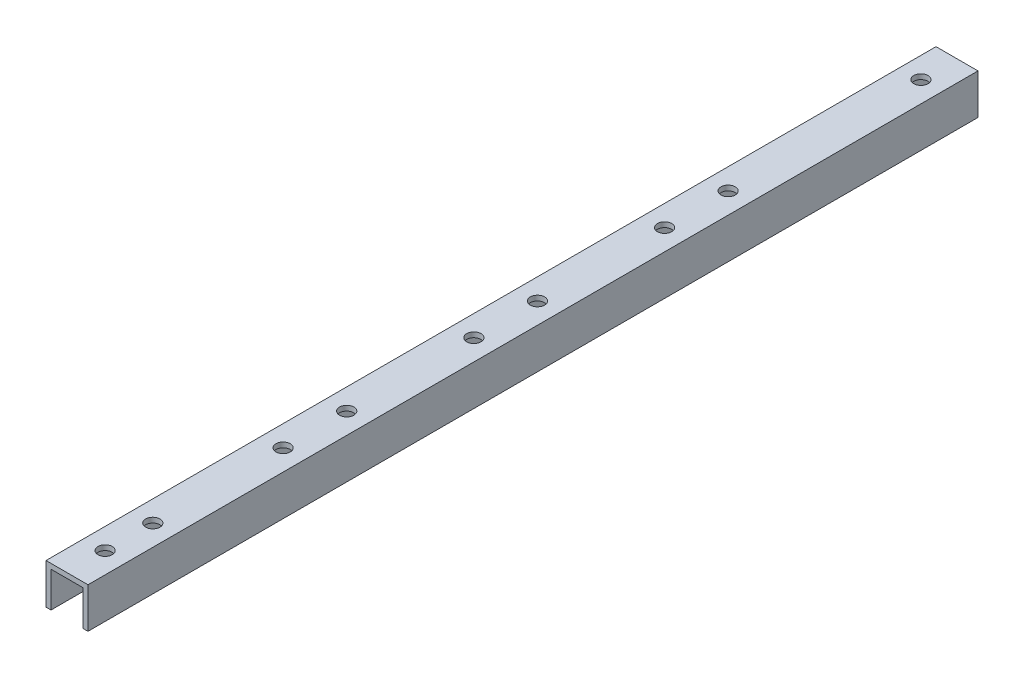
ISO-10303-21;
HEADER;
FILE_DESCRIPTION(('STEP AP214'),'2;1');
FILE_NAME('part.step','',(''),(''),'','','');
FILE_SCHEMA(('AUTOMOTIVE_DESIGN { 1 0 10303 214 1 1 1 1 }'));
ENDSEC;
DATA;
#1=APPLICATION_CONTEXT('core data for automotive mechanical design processes');
#2=APPLICATION_PROTOCOL_DEFINITION('international standard','automotive_design',2000,#1);
#3=PRODUCT_CONTEXT('',#1,'mechanical');
#4=PRODUCT('Part','Part','',(#3));
#5=PRODUCT_RELATED_PRODUCT_CATEGORY('part','',(#4));
#6=PRODUCT_DEFINITION_FORMATION('','',#4);
#7=PRODUCT_DEFINITION_CONTEXT('part definition',#1,'design');
#8=PRODUCT_DEFINITION('design','',#6,#7);
#9=PRODUCT_DEFINITION_SHAPE('','',#8);
#10=(LENGTH_UNIT() NAMED_UNIT(*) SI_UNIT(.MILLI.,.METRE.));
#11=(NAMED_UNIT(*) PLANE_ANGLE_UNIT() SI_UNIT($,.RADIAN.));
#12=(NAMED_UNIT(*) SI_UNIT($,.STERADIAN.) SOLID_ANGLE_UNIT());
#13=UNCERTAINTY_MEASURE_WITH_UNIT(LENGTH_MEASURE(1.E-05),#10,'distance_accuracy_value','');
#14=(GEOMETRIC_REPRESENTATION_CONTEXT(3) GLOBAL_UNCERTAINTY_ASSIGNED_CONTEXT((#13)) GLOBAL_UNIT_ASSIGNED_CONTEXT((#10,
#11,#12)) REPRESENTATION_CONTEXT('',''));
#15=CARTESIAN_POINT('',(0.,0.,0.));
#16=DIRECTION('',(0.,0.,1.));
#17=DIRECTION('',(1.,0.,0.));
#18=AXIS2_PLACEMENT_3D('',#15,#16,#17);
#19=CARTESIAN_POINT('',(-6.604,0.,20.));
#20=DIRECTION('',(0.,-1.,0.));
#21=DIRECTION('',(1.,0.,0.));
#22=AXIS2_PLACEMENT_3D('',#19,#20,#21);
#23=PLANE('',#22);
#24=CARTESIAN_POINT('',(0.,0.,-108.));
#25=DIRECTION('',(0.,1.,0.));
#26=DIRECTION('',(0.,0.,1.));
#27=AXIS2_PLACEMENT_3D('',#24,#25,#26);
#28=CIRCLE('',#27,2.24999999999999);
#29=CARTESIAN_POINT('',(0.,0.,-105.75));
#30=VERTEX_POINT('',#29);
#31=EDGE_CURVE('E408',#30,#30,#28,.T.);
#32=ORIENTED_EDGE('',*,*,#31,.F.);
#33=EDGE_LOOP('',(#32));
#34=FACE_BOUND('',#33,.T.);
#35=CARTESIAN_POINT('',(0.,0.,-128.));
#36=DIRECTION('',(0.,1.,0.));
#37=DIRECTION('',(0.,0.,1.));
#38=AXIS2_PLACEMENT_3D('',#35,#36,#37);
#39=CIRCLE('',#38,2.24999999999999);
#40=CARTESIAN_POINT('',(0.,0.,-125.75));
#41=VERTEX_POINT('',#40);
#42=EDGE_CURVE('E412',#41,#41,#39,.T.);
#43=ORIENTED_EDGE('',*,*,#42,.F.);
#44=EDGE_LOOP('',(#43));
#45=FACE_BOUND('',#44,.T.);
#46=CARTESIAN_POINT('',(0.,0.,8.));
#47=DIRECTION('',(0.,1.,0.));
#48=DIRECTION('',(0.,0.,1.));
#49=AXIS2_PLACEMENT_3D('',#46,#47,#48);
#50=CIRCLE('',#49,2.24999999999999);
#51=CARTESIAN_POINT('',(0.,0.,10.25));
#52=VERTEX_POINT('',#51);
#53=EDGE_CURVE('E418',#52,#52,#50,.T.);
#54=ORIENTED_EDGE('',*,*,#53,.F.);
#55=EDGE_LOOP('',(#54));
#56=FACE_BOUND('',#55,.T.);
#57=CARTESIAN_POINT('',(0.,0.,-188.));
#58=DIRECTION('',(0.,1.,0.));
#59=DIRECTION('',(0.,0.,1.));
#60=AXIS2_PLACEMENT_3D('',#57,#58,#59);
#61=CIRCLE('',#60,2.24999999999999);
#62=CARTESIAN_POINT('',(0.,0.,-185.75));
#63=VERTEX_POINT('',#62);
#64=EDGE_CURVE('E190',#63,#63,#61,.T.);
#65=ORIENTED_EDGE('',*,*,#64,.F.);
#66=EDGE_LOOP('',(#65));
#67=FACE_BOUND('',#66,.T.);
#68=CARTESIAN_POINT('',(0.,0.,-168.));
#69=DIRECTION('',(0.,1.,0.));
#70=DIRECTION('',(0.,0.,1.));
#71=AXIS2_PLACEMENT_3D('',#68,#69,#70);
#72=CIRCLE('',#71,2.24999999999999);
#73=CARTESIAN_POINT('',(0.,0.,-165.75));
#74=VERTEX_POINT('',#73);
#75=EDGE_CURVE('E179',#74,#74,#72,.T.);
#76=ORIENTED_EDGE('',*,*,#75,.F.);
#77=EDGE_LOOP('',(#76));
#78=FACE_BOUND('',#77,.T.);
#79=CARTESIAN_POINT('',(0.,0.,-68.));
#80=DIRECTION('',(0.,1.,0.));
#81=DIRECTION('',(0.,0.,1.));
#82=AXIS2_PLACEMENT_3D('',#79,#80,#81);
#83=CIRCLE('',#82,2.24999999999999);
#84=CARTESIAN_POINT('',(0.,0.,-65.75));
#85=VERTEX_POINT('',#84);
#86=EDGE_CURVE('E176',#85,#85,#83,.T.);
#87=ORIENTED_EDGE('',*,*,#86,.F.);
#88=EDGE_LOOP('',(#87));
#89=FACE_BOUND('',#88,.T.);
#90=CARTESIAN_POINT('',(0.,0.,-7.));
#91=DIRECTION('',(0.,1.,0.));
#92=DIRECTION('',(0.,0.,1.));
#93=AXIS2_PLACEMENT_3D('',#90,#91,#92);
#94=CIRCLE('',#93,2.24999999999999);
#95=CARTESIAN_POINT('',(0.,0.,-4.75000000000001));
#96=VERTEX_POINT('',#95);
#97=EDGE_CURVE('E169',#96,#96,#94,.T.);
#98=ORIENTED_EDGE('',*,*,#97,.F.);
#99=EDGE_LOOP('',(#98));
#100=FACE_BOUND('',#99,.T.);
#101=CARTESIAN_POINT('',(0.,0.,-248.64));
#102=DIRECTION('',(0.,1.,0.));
#103=DIRECTION('',(0.,0.,1.));
#104=AXIS2_PLACEMENT_3D('',#101,#102,#103);
#105=CIRCLE('',#104,2.24999999999999);
#106=CARTESIAN_POINT('',(0.,0.,-246.39));
#107=VERTEX_POINT('',#106);
#108=EDGE_CURVE('E122',#107,#107,#105,.T.);
#109=ORIENTED_EDGE('',*,*,#108,.F.);
#110=EDGE_LOOP('',(#109));
#111=FACE_BOUND('',#110,.T.);
#112=DIRECTION('',(0.,0.,-1.));
#113=VECTOR('',#112,1.);
#114=CARTESIAN_POINT('',(6.604,0.,20.));
#115=LINE('',#114,#113);
#116=CARTESIAN_POINT('',(6.604,0.,20.));
#117=VERTEX_POINT('',#116);
#118=CARTESIAN_POINT('',(6.604,0.,-260.));
#119=VERTEX_POINT('',#118);
#120=EDGE_CURVE('E155',#117,#119,#115,.T.);
#121=ORIENTED_EDGE('',*,*,#120,.T.);
#122=DIRECTION('',(-1.,0.,0.));
#123=VECTOR('',#122,1.);
#124=CARTESIAN_POINT('',(-6.604,0.,-260.));
#125=LINE('',#124,#123);
#126=CARTESIAN_POINT('',(-6.604,0.,-260.));
#127=VERTEX_POINT('',#126);
#128=EDGE_CURVE('E139',#119,#127,#125,.T.);
#129=ORIENTED_EDGE('',*,*,#128,.T.);
#130=DIRECTION('',(0.,0.,-1.));
#131=VECTOR('',#130,1.);
#132=CARTESIAN_POINT('',(-6.604,0.,20.));
#133=LINE('',#132,#131);
#134=CARTESIAN_POINT('',(-6.604,0.,20.));
#135=VERTEX_POINT('',#134);
#136=EDGE_CURVE('E118',#135,#127,#133,.T.);
#137=ORIENTED_EDGE('',*,*,#136,.F.);
#138=DIRECTION('',(-1.,0.,0.));
#139=VECTOR('',#138,1.);
#140=CARTESIAN_POINT('',(-6.604,0.,20.));
#141=LINE('',#140,#139);
#142=EDGE_CURVE('E50',#117,#135,#141,.T.);
#143=ORIENTED_EDGE('',*,*,#142,.F.);
#144=EDGE_LOOP('',(#121,#129,#137,#143));
#145=FACE_BOUND('',#144,.T.);
#146=CARTESIAN_POINT('',(0.,0.,-48.));
#147=DIRECTION('',(0.,1.,0.));
#148=DIRECTION('',(0.,0.,1.));
#149=AXIS2_PLACEMENT_3D('',#146,#147,#148);
#150=CIRCLE('',#149,2.24999999999999);
#151=CARTESIAN_POINT('',(0.,0.,-45.75));
#152=VERTEX_POINT('',#151);
#153=EDGE_CURVE('E173',#152,#152,#150,.T.);
#154=ORIENTED_EDGE('',*,*,#153,.F.);
#155=EDGE_LOOP('',(#154));
#156=FACE_BOUND('',#155,.T.);
#157=ADVANCED_FACE('F33',(#34,#45,#56,#67,#78,#89,#100,#111,#145,#156),#23,.F.);
#158=CARTESIAN_POINT('',(-6.604,0.,20.));
#159=DIRECTION('',(1.,0.,0.));
#160=DIRECTION('',(0.,1.,0.));
#161=AXIS2_PLACEMENT_3D('',#158,#159,#160);
#162=PLANE('',#161);
#163=ORIENTED_EDGE('',*,*,#136,.T.);
#164=DIRECTION('',(0.,-1.,0.));
#165=VECTOR('',#164,1.);
#166=CARTESIAN_POINT('',(-6.604,0.,-260.));
#167=LINE('',#166,#165);
#168=CARTESIAN_POINT('',(-6.604,-12.7,-260.));
#169=VERTEX_POINT('',#168);
#170=EDGE_CURVE('E112',#127,#169,#167,.T.);
#171=ORIENTED_EDGE('',*,*,#170,.T.);
#172=DIRECTION('',(0.,0.,-1.));
#173=VECTOR('',#172,1.);
#174=CARTESIAN_POINT('',(-6.604,-12.7,20.));
#175=LINE('',#174,#173);
#176=CARTESIAN_POINT('',(-6.604,-12.7,20.));
#177=VERTEX_POINT('',#176);
#178=EDGE_CURVE('E11',#177,#169,#175,.T.);
#179=ORIENTED_EDGE('',*,*,#178,.F.);
#180=DIRECTION('',(0.,-1.,0.));
#181=VECTOR('',#180,1.);
#182=CARTESIAN_POINT('',(-6.604,0.,20.));
#183=LINE('',#182,#181);
#184=EDGE_CURVE('E141',#135,#177,#183,.T.);
#185=ORIENTED_EDGE('',*,*,#184,.F.);
#186=EDGE_LOOP('',(#163,#171,#179,#185));
#187=FACE_BOUND('',#186,.T.);
#188=ADVANCED_FACE('F35',(#187),#162,.F.);
#189=CARTESIAN_POINT('',(-6.604,-12.7,20.));
#190=DIRECTION('',(0.,1.,0.));
#191=DIRECTION('',(0.,0.,1.));
#192=AXIS2_PLACEMENT_3D('',#189,#190,#191);
#193=PLANE('',#192);
#194=ORIENTED_EDGE('',*,*,#178,.T.);
#195=DIRECTION('',(1.,0.,0.));
#196=VECTOR('',#195,1.);
#197=CARTESIAN_POINT('',(-6.604,-12.7,-260.));
#198=LINE('',#197,#196);
#199=CARTESIAN_POINT('',(-5.0165,-12.7,-260.));
#200=VERTEX_POINT('',#199);
#201=EDGE_CURVE('E102',#169,#200,#198,.T.);
#202=ORIENTED_EDGE('',*,*,#201,.T.);
#203=DIRECTION('',(0.,0.,-1.));
#204=VECTOR('',#203,1.);
#205=CARTESIAN_POINT('',(-5.0165,-12.7,20.));
#206=LINE('',#205,#204);
#207=CARTESIAN_POINT('',(-5.0165,-12.7,20.));
#208=VERTEX_POINT('',#207);
#209=EDGE_CURVE('E42',#208,#200,#206,.T.);
#210=ORIENTED_EDGE('',*,*,#209,.F.);
#211=DIRECTION('',(1.,0.,0.));
#212=VECTOR('',#211,1.);
#213=CARTESIAN_POINT('',(-6.604,-12.7,20.));
#214=LINE('',#213,#212);
#215=EDGE_CURVE('E103',#177,#208,#214,.T.);
#216=ORIENTED_EDGE('',*,*,#215,.F.);
#217=EDGE_LOOP('',(#194,#202,#210,#216));
#218=FACE_BOUND('',#217,.T.);
#219=ADVANCED_FACE('F100',(#218),#193,.F.);
#220=CARTESIAN_POINT('',(-5.0165,-12.7,20.));
#221=DIRECTION('',(-1.,0.,0.));
#222=DIRECTION('',(0.,-1.,0.));
#223=AXIS2_PLACEMENT_3D('',#220,#221,#222);
#224=PLANE('',#223);
#225=ORIENTED_EDGE('',*,*,#209,.T.);
#226=DIRECTION('',(0.,1.,0.));
#227=VECTOR('',#226,1.);
#228=CARTESIAN_POINT('',(-5.0165,-12.7,-260.));
#229=LINE('',#228,#227);
#230=CARTESIAN_POINT('',(-5.0165,-1.5875,-260.));
#231=VERTEX_POINT('',#230);
#232=EDGE_CURVE('E116',#200,#231,#229,.T.);
#233=ORIENTED_EDGE('',*,*,#232,.T.);
#234=DIRECTION('',(0.,0.,-1.));
#235=VECTOR('',#234,1.);
#236=CARTESIAN_POINT('',(-5.0165,-1.5875,20.));
#237=LINE('',#236,#235);
#238=CARTESIAN_POINT('',(-5.0165,-1.5875,20.));
#239=VERTEX_POINT('',#238);
#240=EDGE_CURVE('E163',#239,#231,#237,.T.);
#241=ORIENTED_EDGE('',*,*,#240,.F.);
#242=DIRECTION('',(0.,1.,0.));
#243=VECTOR('',#242,1.);
#244=CARTESIAN_POINT('',(-5.0165,-12.7,20.));
#245=LINE('',#244,#243);
#246=EDGE_CURVE('E144',#208,#239,#245,.T.);
#247=ORIENTED_EDGE('',*,*,#246,.F.);
#248=EDGE_LOOP('',(#225,#233,#241,#247));
#249=FACE_BOUND('',#248,.T.);
#250=ADVANCED_FACE('F222',(#249),#224,.F.);
#251=CARTESIAN_POINT('',(5.0165,-1.5875,20.));
#252=DIRECTION('',(0.,1.,0.));
#253=DIRECTION('',(-1.,0.,0.));
#254=AXIS2_PLACEMENT_3D('',#251,#252,#253);
#255=PLANE('',#254);
#256=CARTESIAN_POINT('',(0.,-1.5875,-108.));
#257=DIRECTION('',(0.,1.,0.));
#258=DIRECTION('',(-1.,0.,0.));
#259=AXIS2_PLACEMENT_3D('',#256,#257,#258);
#260=CIRCLE('',#259,2.24999999999997);
#261=CARTESIAN_POINT('',(-2.24999999999997,-1.5875,-108.));
#262=VERTEX_POINT('',#261);
#263=EDGE_CURVE('E411',#262,#262,#260,.T.);
#264=ORIENTED_EDGE('',*,*,#263,.T.);
#265=EDGE_LOOP('',(#264));
#266=FACE_BOUND('',#265,.T.);
#267=CARTESIAN_POINT('',(0.,-1.5875,-128.));
#268=DIRECTION('',(0.,1.,0.));
#269=DIRECTION('',(-1.,0.,0.));
#270=AXIS2_PLACEMENT_3D('',#267,#268,#269);
#271=CIRCLE('',#270,2.24999999999997);
#272=CARTESIAN_POINT('',(-2.24999999999997,-1.5875,-128.));
#273=VERTEX_POINT('',#272);
#274=EDGE_CURVE('E37',#273,#273,#271,.T.);
#275=ORIENTED_EDGE('',*,*,#274,.T.);
#276=EDGE_LOOP('',(#275));
#277=FACE_BOUND('',#276,.T.);
#278=CARTESIAN_POINT('',(0.,-1.5875,8.));
#279=DIRECTION('',(0.,1.,0.));
#280=DIRECTION('',(-1.,0.,0.));
#281=AXIS2_PLACEMENT_3D('',#278,#279,#280);
#282=CIRCLE('',#281,2.24999999999997);
#283=CARTESIAN_POINT('',(-2.24999999999997,-1.5875,8.));
#284=VERTEX_POINT('',#283);
#285=EDGE_CURVE('E421',#284,#284,#282,.T.);
#286=ORIENTED_EDGE('',*,*,#285,.T.);
#287=EDGE_LOOP('',(#286));
#288=FACE_BOUND('',#287,.T.);
#289=CARTESIAN_POINT('',(0.,-1.5875,-188.));
#290=DIRECTION('',(0.,1.,0.));
#291=DIRECTION('',(-1.,0.,0.));
#292=AXIS2_PLACEMENT_3D('',#289,#290,#291);
#293=CIRCLE('',#292,2.24999999999997);
#294=CARTESIAN_POINT('',(-2.24999999999997,-1.5875,-188.));
#295=VERTEX_POINT('',#294);
#296=EDGE_CURVE('E185',#295,#295,#293,.T.);
#297=ORIENTED_EDGE('',*,*,#296,.T.);
#298=EDGE_LOOP('',(#297));
#299=FACE_BOUND('',#298,.T.);
#300=CARTESIAN_POINT('',(0.,-1.5875,-168.));
#301=DIRECTION('',(0.,1.,0.));
#302=DIRECTION('',(-1.,0.,0.));
#303=AXIS2_PLACEMENT_3D('',#300,#301,#302);
#304=CIRCLE('',#303,2.24999999999997);
#305=CARTESIAN_POINT('',(-2.24999999999997,-1.5875,-168.));
#306=VERTEX_POINT('',#305);
#307=EDGE_CURVE('E177',#306,#306,#304,.T.);
#308=ORIENTED_EDGE('',*,*,#307,.T.);
#309=EDGE_LOOP('',(#308));
#310=FACE_BOUND('',#309,.T.);
#311=CARTESIAN_POINT('',(0.,-1.5875,-68.));
#312=DIRECTION('',(0.,1.,0.));
#313=DIRECTION('',(-1.,0.,0.));
#314=AXIS2_PLACEMENT_3D('',#311,#312,#313);
#315=CIRCLE('',#314,2.24999999999997);
#316=CARTESIAN_POINT('',(-2.24999999999997,-1.5875,-68.));
#317=VERTEX_POINT('',#316);
#318=EDGE_CURVE('E174',#317,#317,#315,.T.);
#319=ORIENTED_EDGE('',*,*,#318,.T.);
#320=EDGE_LOOP('',(#319));
#321=FACE_BOUND('',#320,.T.);
#322=CARTESIAN_POINT('',(0.,-1.5875,-48.));
#323=DIRECTION('',(0.,1.,0.));
#324=DIRECTION('',(-1.,0.,0.));
#325=AXIS2_PLACEMENT_3D('',#322,#323,#324);
#326=CIRCLE('',#325,2.24999999999997);
#327=CARTESIAN_POINT('',(-2.24999999999997,-1.5875,-48.));
#328=VERTEX_POINT('',#327);
#329=EDGE_CURVE('E170',#328,#328,#326,.T.);
#330=ORIENTED_EDGE('',*,*,#329,.T.);
#331=EDGE_LOOP('',(#330));
#332=FACE_BOUND('',#331,.T.);
#333=CARTESIAN_POINT('',(0.,-1.5875,-7.));
#334=DIRECTION('',(0.,1.,0.));
#335=DIRECTION('',(-1.,0.,0.));
#336=AXIS2_PLACEMENT_3D('',#333,#334,#335);
#337=CIRCLE('',#336,2.24999999999997);
#338=CARTESIAN_POINT('',(-2.24999999999997,-1.5875,-7.));
#339=VERTEX_POINT('',#338);
#340=EDGE_CURVE('E166',#339,#339,#337,.T.);
#341=ORIENTED_EDGE('',*,*,#340,.T.);
#342=EDGE_LOOP('',(#341));
#343=FACE_BOUND('',#342,.T.);
#344=CARTESIAN_POINT('',(0.,-1.5875,-248.64));
#345=DIRECTION('',(0.,1.,0.));
#346=DIRECTION('',(-1.,0.,0.));
#347=AXIS2_PLACEMENT_3D('',#344,#345,#346);
#348=CIRCLE('',#347,2.24999999999997);
#349=CARTESIAN_POINT('',(-2.24999999999997,-1.5875,-248.64));
#350=VERTEX_POINT('',#349);
#351=EDGE_CURVE('E119',#350,#350,#348,.T.);
#352=ORIENTED_EDGE('',*,*,#351,.T.);
#353=EDGE_LOOP('',(#352));
#354=FACE_BOUND('',#353,.T.);
#355=ORIENTED_EDGE('',*,*,#240,.T.);
#356=DIRECTION('',(1.,0.,0.));
#357=VECTOR('',#356,1.);
#358=CARTESIAN_POINT('',(5.0165,-1.5875,-260.));
#359=LINE('',#358,#357);
#360=CARTESIAN_POINT('',(5.0165,-1.5875,-260.));
#361=VERTEX_POINT('',#360);
#362=EDGE_CURVE('E127',#231,#361,#359,.T.);
#363=ORIENTED_EDGE('',*,*,#362,.T.);
#364=DIRECTION('',(0.,0.,-1.));
#365=VECTOR('',#364,1.);
#366=CARTESIAN_POINT('',(5.0165,-1.5875,20.));
#367=LINE('',#366,#365);
#368=CARTESIAN_POINT('',(5.0165,-1.5875,20.));
#369=VERTEX_POINT('',#368);
#370=EDGE_CURVE('E161',#369,#361,#367,.T.);
#371=ORIENTED_EDGE('',*,*,#370,.F.);
#372=DIRECTION('',(1.,0.,0.));
#373=VECTOR('',#372,1.);
#374=CARTESIAN_POINT('',(5.0165,-1.5875,20.));
#375=LINE('',#374,#373);
#376=EDGE_CURVE('E146',#239,#369,#375,.T.);
#377=ORIENTED_EDGE('',*,*,#376,.F.);
#378=EDGE_LOOP('',(#355,#363,#371,#377));
#379=FACE_BOUND('',#378,.T.);
#380=ADVANCED_FACE('F218',(#266,#277,#288,#299,#310,#321,#332,#343,#354,#379),#255,.F.);
#381=CARTESIAN_POINT('',(5.0165,-12.7,20.));
#382=DIRECTION('',(1.,0.,0.));
#383=DIRECTION('',(0.,0.,-1.));
#384=AXIS2_PLACEMENT_3D('',#381,#382,#383);
#385=PLANE('',#384);
#386=ORIENTED_EDGE('',*,*,#370,.T.);
#387=DIRECTION('',(0.,-1.,0.));
#388=VECTOR('',#387,1.);
#389=CARTESIAN_POINT('',(5.0165,-12.7,-260.));
#390=LINE('',#389,#388);
#391=CARTESIAN_POINT('',(5.0165,-12.7,-260.));
#392=VERTEX_POINT('',#391);
#393=EDGE_CURVE('E130',#361,#392,#390,.T.);
#394=ORIENTED_EDGE('',*,*,#393,.T.);
#395=DIRECTION('',(0.,0.,-1.));
#396=VECTOR('',#395,1.);
#397=CARTESIAN_POINT('',(5.0165,-12.7,20.));
#398=LINE('',#397,#396);
#399=CARTESIAN_POINT('',(5.0165,-12.7,20.));
#400=VERTEX_POINT('',#399);
#401=EDGE_CURVE('E159',#400,#392,#398,.T.);
#402=ORIENTED_EDGE('',*,*,#401,.F.);
#403=DIRECTION('',(0.,-1.,0.));
#404=VECTOR('',#403,1.);
#405=CARTESIAN_POINT('',(5.0165,-12.7,20.));
#406=LINE('',#405,#404);
#407=EDGE_CURVE('E148',#369,#400,#406,.T.);
#408=ORIENTED_EDGE('',*,*,#407,.F.);
#409=EDGE_LOOP('',(#386,#394,#402,#408));
#410=FACE_BOUND('',#409,.T.);
#411=ADVANCED_FACE('F221',(#410),#385,.F.);
#412=CARTESIAN_POINT('',(6.604,-12.7,20.));
#413=DIRECTION('',(0.,1.,0.));
#414=DIRECTION('',(0.,0.,1.));
#415=AXIS2_PLACEMENT_3D('',#412,#413,#414);
#416=PLANE('',#415);
#417=ORIENTED_EDGE('',*,*,#401,.T.);
#418=DIRECTION('',(1.,0.,0.));
#419=VECTOR('',#418,1.);
#420=CARTESIAN_POINT('',(6.604,-12.7,-260.));
#421=LINE('',#420,#419);
#422=CARTESIAN_POINT('',(6.604,-12.7,-260.));
#423=VERTEX_POINT('',#422);
#424=EDGE_CURVE('E133',#392,#423,#421,.T.);
#425=ORIENTED_EDGE('',*,*,#424,.T.);
#426=DIRECTION('',(0.,0.,-1.));
#427=VECTOR('',#426,1.);
#428=CARTESIAN_POINT('',(6.604,-12.7,20.));
#429=LINE('',#428,#427);
#430=CARTESIAN_POINT('',(6.604,-12.7,20.));
#431=VERTEX_POINT('',#430);
#432=EDGE_CURVE('E157',#431,#423,#429,.T.);
#433=ORIENTED_EDGE('',*,*,#432,.F.);
#434=DIRECTION('',(1.,0.,0.));
#435=VECTOR('',#434,1.);
#436=CARTESIAN_POINT('',(6.604,-12.7,20.));
#437=LINE('',#436,#435);
#438=EDGE_CURVE('E150',#400,#431,#437,.T.);
#439=ORIENTED_EDGE('',*,*,#438,.F.);
#440=EDGE_LOOP('',(#417,#425,#433,#439));
#441=FACE_BOUND('',#440,.T.);
#442=ADVANCED_FACE('F243',(#441),#416,.F.);
#443=CARTESIAN_POINT('',(6.604,0.,20.));
#444=DIRECTION('',(-1.,0.,0.));
#445=DIRECTION('',(0.,-1.,0.));
#446=AXIS2_PLACEMENT_3D('',#443,#444,#445);
#447=PLANE('',#446);
#448=ORIENTED_EDGE('',*,*,#432,.T.);
#449=DIRECTION('',(0.,1.,0.));
#450=VECTOR('',#449,1.);
#451=CARTESIAN_POINT('',(6.604,0.,-260.));
#452=LINE('',#451,#450);
#453=EDGE_CURVE('E136',#423,#119,#452,.T.);
#454=ORIENTED_EDGE('',*,*,#453,.T.);
#455=ORIENTED_EDGE('',*,*,#120,.F.);
#456=DIRECTION('',(0.,1.,0.));
#457=VECTOR('',#456,1.);
#458=CARTESIAN_POINT('',(6.604,0.,20.));
#459=LINE('',#458,#457);
#460=EDGE_CURVE('E55',#431,#117,#459,.T.);
#461=ORIENTED_EDGE('',*,*,#460,.F.);
#462=EDGE_LOOP('',(#448,#454,#455,#461));
#463=FACE_BOUND('',#462,.T.);
#464=ADVANCED_FACE('F246',(#463),#447,.F.);
#465=CARTESIAN_POINT('',(0.,0.,20.));
#466=DIRECTION('',(0.,0.,1.));
#467=DIRECTION('',(1.,0.,0.));
#468=AXIS2_PLACEMENT_3D('',#465,#466,#467);
#469=PLANE('',#468);
#470=ORIENTED_EDGE('',*,*,#184,.T.);
#471=ORIENTED_EDGE('',*,*,#215,.T.);
#472=ORIENTED_EDGE('',*,*,#246,.T.);
#473=ORIENTED_EDGE('',*,*,#376,.T.);
#474=ORIENTED_EDGE('',*,*,#407,.T.);
#475=ORIENTED_EDGE('',*,*,#438,.T.);
#476=ORIENTED_EDGE('',*,*,#460,.T.);
#477=ORIENTED_EDGE('',*,*,#142,.T.);
#478=EDGE_LOOP('',(#470,#471,#472,#473,#474,#475,#476,#477));
#479=FACE_BOUND('',#478,.T.);
#480=ADVANCED_FACE('F236',(#479),#469,.T.);
#481=CARTESIAN_POINT('',(0.,0.,-260.));
#482=DIRECTION('',(0.,0.,1.));
#483=DIRECTION('',(1.,0.,0.));
#484=AXIS2_PLACEMENT_3D('',#481,#482,#483);
#485=PLANE('',#484);
#486=ORIENTED_EDGE('',*,*,#170,.F.);
#487=ORIENTED_EDGE('',*,*,#128,.F.);
#488=ORIENTED_EDGE('',*,*,#453,.F.);
#489=ORIENTED_EDGE('',*,*,#424,.F.);
#490=ORIENTED_EDGE('',*,*,#393,.F.);
#491=ORIENTED_EDGE('',*,*,#362,.F.);
#492=ORIENTED_EDGE('',*,*,#232,.F.);
#493=ORIENTED_EDGE('',*,*,#201,.F.);
#494=EDGE_LOOP('',(#486,#487,#488,#489,#490,#491,#492,#493));
#495=FACE_BOUND('',#494,.T.);
#496=ADVANCED_FACE('F110',(#495),#485,.F.);
#497=CARTESIAN_POINT('',(0.,0.,-248.64));
#498=DIRECTION('',(0.,1.,0.));
#499=DIRECTION('',(0.,0.,1.));
#500=AXIS2_PLACEMENT_3D('',#497,#498,#499);
#501=CYLINDRICAL_SURFACE('',#500,2.24999999999997);
#502=ORIENTED_EDGE('',*,*,#108,.T.);
#503=EDGE_LOOP('',(#502));
#504=FACE_BOUND('',#503,.T.);
#505=ORIENTED_EDGE('',*,*,#351,.F.);
#506=EDGE_LOOP('',(#505));
#507=FACE_BOUND('',#506,.T.);
#508=ADVANCED_FACE('F200',(#504,#507),#501,.F.);
#509=CARTESIAN_POINT('',(0.,0.,-7.));
#510=DIRECTION('',(0.,1.,0.));
#511=DIRECTION('',(0.,0.,1.));
#512=AXIS2_PLACEMENT_3D('',#509,#510,#511);
#513=CYLINDRICAL_SURFACE('',#512,2.24999999999997);
#514=ORIENTED_EDGE('',*,*,#97,.T.);
#515=EDGE_LOOP('',(#514));
#516=FACE_BOUND('',#515,.T.);
#517=ORIENTED_EDGE('',*,*,#340,.F.);
#518=EDGE_LOOP('',(#517));
#519=FACE_BOUND('',#518,.T.);
#520=ADVANCED_FACE('F214',(#516,#519),#513,.F.);
#521=CARTESIAN_POINT('',(0.,0.,-48.));
#522=DIRECTION('',(0.,1.,0.));
#523=DIRECTION('',(0.,0.,1.));
#524=AXIS2_PLACEMENT_3D('',#521,#522,#523);
#525=CYLINDRICAL_SURFACE('',#524,2.24999999999997);
#526=ORIENTED_EDGE('',*,*,#153,.T.);
#527=EDGE_LOOP('',(#526));
#528=FACE_BOUND('',#527,.T.);
#529=ORIENTED_EDGE('',*,*,#329,.F.);
#530=EDGE_LOOP('',(#529));
#531=FACE_BOUND('',#530,.T.);
#532=ADVANCED_FACE('F210',(#528,#531),#525,.F.);
#533=CARTESIAN_POINT('',(0.,0.,-68.));
#534=DIRECTION('',(0.,1.,0.));
#535=DIRECTION('',(0.,0.,1.));
#536=AXIS2_PLACEMENT_3D('',#533,#534,#535);
#537=CYLINDRICAL_SURFACE('',#536,2.24999999999997);
#538=ORIENTED_EDGE('',*,*,#86,.T.);
#539=EDGE_LOOP('',(#538));
#540=FACE_BOUND('',#539,.T.);
#541=ORIENTED_EDGE('',*,*,#318,.F.);
#542=EDGE_LOOP('',(#541));
#543=FACE_BOUND('',#542,.T.);
#544=ADVANCED_FACE('F213',(#540,#543),#537,.F.);
#545=CARTESIAN_POINT('',(0.,0.,-168.));
#546=DIRECTION('',(0.,1.,0.));
#547=DIRECTION('',(0.,0.,1.));
#548=AXIS2_PLACEMENT_3D('',#545,#546,#547);
#549=CYLINDRICAL_SURFACE('',#548,2.24999999999997);
#550=ORIENTED_EDGE('',*,*,#75,.T.);
#551=EDGE_LOOP('',(#550));
#552=FACE_BOUND('',#551,.T.);
#553=ORIENTED_EDGE('',*,*,#307,.F.);
#554=EDGE_LOOP('',(#553));
#555=FACE_BOUND('',#554,.T.);
#556=ADVANCED_FACE('F297',(#552,#555),#549,.F.);
#557=CARTESIAN_POINT('',(0.,0.,-188.));
#558=DIRECTION('',(0.,1.,0.));
#559=DIRECTION('',(0.,0.,1.));
#560=AXIS2_PLACEMENT_3D('',#557,#558,#559);
#561=CYLINDRICAL_SURFACE('',#560,2.24999999999997);
#562=ORIENTED_EDGE('',*,*,#64,.T.);
#563=EDGE_LOOP('',(#562));
#564=FACE_BOUND('',#563,.T.);
#565=ORIENTED_EDGE('',*,*,#296,.F.);
#566=EDGE_LOOP('',(#565));
#567=FACE_BOUND('',#566,.T.);
#568=ADVANCED_FACE('F307',(#564,#567),#561,.F.);
#569=CARTESIAN_POINT('',(0.,0.,8.));
#570=DIRECTION('',(0.,1.,0.));
#571=DIRECTION('',(0.,0.,1.));
#572=AXIS2_PLACEMENT_3D('',#569,#570,#571);
#573=CYLINDRICAL_SURFACE('',#572,2.24999999999997);
#574=ORIENTED_EDGE('',*,*,#53,.T.);
#575=EDGE_LOOP('',(#574));
#576=FACE_BOUND('',#575,.T.);
#577=ORIENTED_EDGE('',*,*,#285,.F.);
#578=EDGE_LOOP('',(#577));
#579=FACE_BOUND('',#578,.T.);
#580=ADVANCED_FACE('F316',(#576,#579),#573,.F.);
#581=CARTESIAN_POINT('',(0.,0.,-128.));
#582=DIRECTION('',(0.,1.,0.));
#583=DIRECTION('',(0.,0.,1.));
#584=AXIS2_PLACEMENT_3D('',#581,#582,#583);
#585=CYLINDRICAL_SURFACE('',#584,2.24999999999997);
#586=ORIENTED_EDGE('',*,*,#42,.T.);
#587=EDGE_LOOP('',(#586));
#588=FACE_BOUND('',#587,.T.);
#589=ORIENTED_EDGE('',*,*,#274,.F.);
#590=EDGE_LOOP('',(#589));
#591=FACE_BOUND('',#590,.T.);
#592=ADVANCED_FACE('F326',(#588,#591),#585,.F.);
#593=CARTESIAN_POINT('',(0.,0.,-108.));
#594=DIRECTION('',(0.,1.,0.));
#595=DIRECTION('',(0.,0.,1.));
#596=AXIS2_PLACEMENT_3D('',#593,#594,#595);
#597=CYLINDRICAL_SURFACE('',#596,2.24999999999997);
#598=ORIENTED_EDGE('',*,*,#31,.T.);
#599=EDGE_LOOP('',(#598));
#600=FACE_BOUND('',#599,.T.);
#601=ORIENTED_EDGE('',*,*,#263,.F.);
#602=EDGE_LOOP('',(#601));
#603=FACE_BOUND('',#602,.T.);
#604=ADVANCED_FACE('F336',(#600,#603),#597,.F.);
#605=CLOSED_SHELL('',(#157,#188,#219,#250,#380,#411,#442,#464,#480,#496,#508,#520,#532,#544,
#556,#568,#580,#592,#604));
#606=MANIFOLD_SOLID_BREP('B2',#605);
#607=ADVANCED_BREP_SHAPE_REPRESENTATION('',(#18,#606),#14);
#608=SHAPE_DEFINITION_REPRESENTATION(#9,#607);
ENDSEC;
END-ISO-10303-21;
